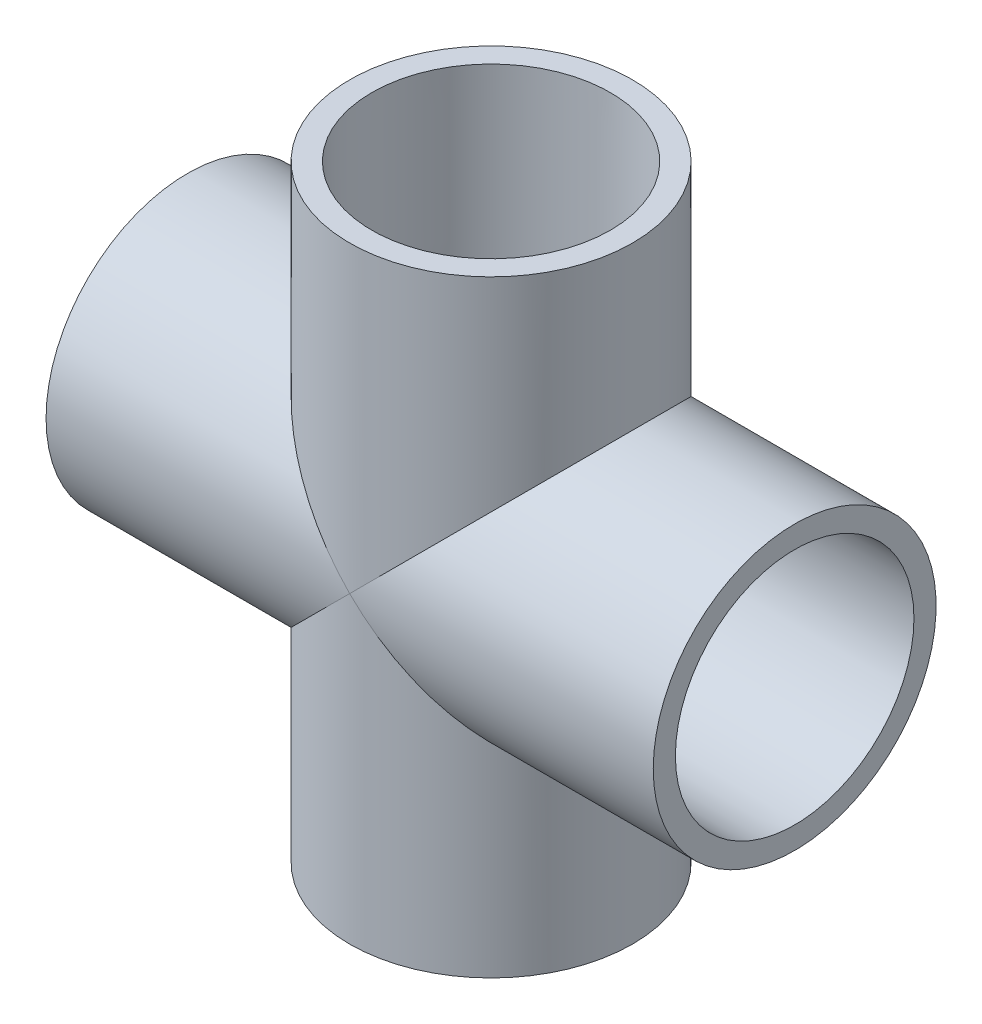
ISO-10303-21;
HEADER;
FILE_DESCRIPTION(('STEP AP214'),'2;1');
FILE_NAME('part.step','',(''),(''),'','','');
FILE_SCHEMA(('AUTOMOTIVE_DESIGN { 1 0 10303 214 1 1 1 1 }'));
ENDSEC;
DATA;
#1=APPLICATION_CONTEXT('core data for automotive mechanical design processes');
#2=APPLICATION_PROTOCOL_DEFINITION('international standard','automotive_design',2000,#1);
#3=PRODUCT_CONTEXT('',#1,'mechanical');
#4=PRODUCT('Part','Part','',(#3));
#5=PRODUCT_RELATED_PRODUCT_CATEGORY('part','',(#4));
#6=PRODUCT_DEFINITION_FORMATION('','',#4);
#7=PRODUCT_DEFINITION_CONTEXT('part definition',#1,'design');
#8=PRODUCT_DEFINITION('design','',#6,#7);
#9=PRODUCT_DEFINITION_SHAPE('','',#8);
#10=(LENGTH_UNIT() NAMED_UNIT(*) SI_UNIT(.MILLI.,.METRE.));
#11=(NAMED_UNIT(*) PLANE_ANGLE_UNIT() SI_UNIT($,.RADIAN.));
#12=(NAMED_UNIT(*) SI_UNIT($,.STERADIAN.) SOLID_ANGLE_UNIT());
#13=UNCERTAINTY_MEASURE_WITH_UNIT(LENGTH_MEASURE(1.E-05),#10,'distance_accuracy_value','');
#14=(GEOMETRIC_REPRESENTATION_CONTEXT(3) GLOBAL_UNCERTAINTY_ASSIGNED_CONTEXT((#13)) GLOBAL_UNIT_ASSIGNED_CONTEXT((#10,
#11,#12)) REPRESENTATION_CONTEXT('',''));
#15=CARTESIAN_POINT('',(0.,0.,0.));
#16=DIRECTION('',(0.,0.,1.));
#17=DIRECTION('',(1.,0.,0.));
#18=AXIS2_PLACEMENT_3D('',#15,#16,#17);
#19=CARTESIAN_POINT('',(0.,22.225,0.));
#20=DIRECTION('',(0.,-1.,0.));
#21=DIRECTION('',(1.,0.,0.));
#22=AXIS2_PLACEMENT_3D('',#19,#20,#21);
#23=PLANE('',#22);
#24=CARTESIAN_POINT('',(0.,22.225,0.));
#25=DIRECTION('',(0.,-1.,0.));
#26=DIRECTION('',(1.,0.,0.));
#27=AXIS2_PLACEMENT_3D('',#24,#25,#26);
#28=CIRCLE('',#27,21.0185);
#29=CARTESIAN_POINT('',(21.0185,22.225,0.));
#30=VERTEX_POINT('',#29);
#31=EDGE_CURVE('E80',#30,#30,#28,.T.);
#32=ORIENTED_EDGE('',*,*,#31,.F.);
#33=EDGE_LOOP('',(#32));
#34=FACE_BOUND('',#33,.T.);
#35=CARTESIAN_POINT('',(0.,22.225,0.));
#36=DIRECTION('',(0.,1.,0.));
#37=DIRECTION('',(-1.,0.,0.));
#38=AXIS2_PLACEMENT_3D('',#35,#36,#37);
#39=CIRCLE('',#38,17.526);
#40=CARTESIAN_POINT('',(-17.526,22.225,0.));
#41=VERTEX_POINT('',#40);
#42=EDGE_CURVE('E124',#41,#41,#39,.T.);
#43=ORIENTED_EDGE('',*,*,#42,.F.);
#44=EDGE_LOOP('',(#43));
#45=FACE_BOUND('',#44,.T.);
#46=ADVANCED_FACE('F32',(#34,#45),#23,.F.);
#47=CARTESIAN_POINT('',(0.,-22.225,0.));
#48=DIRECTION('',(0.,-1.,0.));
#49=DIRECTION('',(1.,0.,0.));
#50=AXIS2_PLACEMENT_3D('',#47,#48,#49);
#51=PLANE('',#50);
#52=CARTESIAN_POINT('',(0.,-22.225,0.));
#53=DIRECTION('',(0.,1.,0.));
#54=DIRECTION('',(-1.,0.,0.));
#55=AXIS2_PLACEMENT_3D('',#52,#53,#54);
#56=CIRCLE('',#55,17.526);
#57=CARTESIAN_POINT('',(-17.526,-22.225,0.));
#58=VERTEX_POINT('',#57);
#59=EDGE_CURVE('E127',#58,#58,#56,.T.);
#60=ORIENTED_EDGE('',*,*,#59,.T.);
#61=EDGE_LOOP('',(#60));
#62=FACE_BOUND('',#61,.T.);
#63=CARTESIAN_POINT('',(0.,-22.225,0.));
#64=DIRECTION('',(0.,-1.,0.));
#65=DIRECTION('',(1.,0.,0.));
#66=AXIS2_PLACEMENT_3D('',#63,#64,#65);
#67=CIRCLE('',#66,21.0185);
#68=CARTESIAN_POINT('',(21.0185,-22.225,0.));
#69=VERTEX_POINT('',#68);
#70=EDGE_CURVE('E115',#69,#69,#67,.T.);
#71=ORIENTED_EDGE('',*,*,#70,.T.);
#72=EDGE_LOOP('',(#71));
#73=FACE_BOUND('',#72,.T.);
#74=ADVANCED_FACE('F131',(#62,#73),#51,.T.);
#75=CARTESIAN_POINT('',(53.975,0.,0.));
#76=DIRECTION('',(1.,0.,0.));
#77=DIRECTION('',(0.,0.,-1.));
#78=AXIS2_PLACEMENT_3D('',#75,#76,#77);
#79=CYLINDRICAL_SURFACE('',#78,17.526);
#80=CARTESIAN_POINT('',(22.225,0.,0.));
#81=DIRECTION('',(1.,0.,0.));
#82=DIRECTION('',(0.,0.,-1.));
#83=AXIS2_PLACEMENT_3D('',#80,#81,#82);
#84=CIRCLE('',#83,17.526);
#85=CARTESIAN_POINT('',(22.225,0.,-17.526));
#86=VERTEX_POINT('',#85);
#87=EDGE_CURVE('E121',#86,#86,#84,.T.);
#88=ORIENTED_EDGE('',*,*,#87,.T.);
#89=EDGE_LOOP('',(#88));
#90=FACE_BOUND('',#89,.T.);
#91=CARTESIAN_POINT('',(0.,0.,0.));
#92=DIRECTION('',(0.707106781186548,-0.707106781186547,0.));
#93=DIRECTION('',(0.707106781186547,0.707106781186548,0.));
#94=AXIS2_PLACEMENT_3D('',#91,#92,#93);
#95=ELLIPSE('',#94,24.7855068941509,17.526);
#96=CARTESIAN_POINT('',(0.,0.,17.526));
#97=VERTEX_POINT('',#96);
#98=CARTESIAN_POINT('',(0.,0.,-17.526));
#99=VERTEX_POINT('',#98);
#100=EDGE_CURVE('E45',#97,#99,#95,.F.);
#101=ORIENTED_EDGE('',*,*,#100,.T.);
#102=CARTESIAN_POINT('',(0.,0.,0.));
#103=DIRECTION('',(0.707106781186547,0.707106781186548,0.));
#104=DIRECTION('',(0.707106781186548,-0.707106781186547,0.));
#105=AXIS2_PLACEMENT_3D('',#102,#103,#104);
#106=ELLIPSE('',#105,24.7855068941509,17.526);
#107=EDGE_CURVE('E11',#99,#97,#106,.F.);
#108=ORIENTED_EDGE('',*,*,#107,.T.);
#109=EDGE_LOOP('',(#101,#108));
#110=FACE_BOUND('',#109,.T.);
#111=ADVANCED_FACE('F72',(#90,#110),#79,.F.);
#112=CARTESIAN_POINT('',(-22.225,0.,0.));
#113=DIRECTION('',(1.,0.,0.));
#114=DIRECTION('',(0.,0.,-1.));
#115=AXIS2_PLACEMENT_3D('',#112,#113,#114);
#116=CIRCLE('',#115,17.526);
#117=CARTESIAN_POINT('',(-22.225,0.,-17.526));
#118=VERTEX_POINT('',#117);
#119=EDGE_CURVE('E118',#118,#118,#116,.T.);
#120=ORIENTED_EDGE('',*,*,#119,.F.);
#121=EDGE_LOOP('',(#120));
#122=FACE_BOUND('',#121,.T.);
#123=CARTESIAN_POINT('',(0.,0.,0.));
#124=DIRECTION('',(0.707106781186548,-0.707106781186547,0.));
#125=DIRECTION('',(0.707106781186547,0.707106781186548,0.));
#126=AXIS2_PLACEMENT_3D('',#123,#124,#125);
#127=ELLIPSE('',#126,24.7855068941509,17.526);
#128=EDGE_CURVE('E62',#97,#99,#127,.T.);
#129=ORIENTED_EDGE('',*,*,#128,.T.);
#130=CARTESIAN_POINT('',(0.,0.,0.));
#131=DIRECTION('',(0.707106781186547,0.707106781186548,0.));
#132=DIRECTION('',(0.707106781186548,-0.707106781186547,0.));
#133=AXIS2_PLACEMENT_3D('',#130,#131,#132);
#134=ELLIPSE('',#133,24.7855068941509,17.526);
#135=EDGE_CURVE('E40',#99,#97,#134,.T.);
#136=ORIENTED_EDGE('',*,*,#135,.T.);
#137=EDGE_LOOP('',(#129,#136));
#138=FACE_BOUND('',#137,.T.);
#139=ADVANCED_FACE('F73',(#122,#138),#79,.F.);
#140=CARTESIAN_POINT('',(-22.225,0.,0.));
#141=DIRECTION('',(1.,0.,0.));
#142=DIRECTION('',(0.,0.,-1.));
#143=AXIS2_PLACEMENT_3D('',#140,#141,#142);
#144=PLANE('',#143);
#145=ORIENTED_EDGE('',*,*,#119,.T.);
#146=EDGE_LOOP('',(#145));
#147=FACE_BOUND('',#146,.T.);
#148=CARTESIAN_POINT('',(-22.225,0.,0.));
#149=DIRECTION('',(-1.,0.,0.));
#150=DIRECTION('',(0.,0.,1.));
#151=AXIS2_PLACEMENT_3D('',#148,#149,#150);
#152=CIRCLE('',#151,21.0185);
#153=CARTESIAN_POINT('',(-22.225,0.,21.0185));
#154=VERTEX_POINT('',#153);
#155=EDGE_CURVE('E92',#154,#154,#152,.T.);
#156=ORIENTED_EDGE('',*,*,#155,.T.);
#157=EDGE_LOOP('',(#156));
#158=FACE_BOUND('',#157,.T.);
#159=ADVANCED_FACE('F179',(#147,#158),#144,.F.);
#160=CARTESIAN_POINT('',(22.225,0.,0.));
#161=DIRECTION('',(1.,0.,0.));
#162=DIRECTION('',(0.,0.,-1.));
#163=AXIS2_PLACEMENT_3D('',#160,#161,#162);
#164=PLANE('',#163);
#165=CARTESIAN_POINT('',(22.225,0.,0.));
#166=DIRECTION('',(1.,0.,0.));
#167=DIRECTION('',(0.,0.,-1.));
#168=AXIS2_PLACEMENT_3D('',#165,#166,#167);
#169=CIRCLE('',#168,21.0185);
#170=CARTESIAN_POINT('',(22.225,0.,-21.0185));
#171=VERTEX_POINT('',#170);
#172=EDGE_CURVE('E70',#171,#171,#169,.F.);
#173=ORIENTED_EDGE('',*,*,#172,.F.);
#174=EDGE_LOOP('',(#173));
#175=FACE_BOUND('',#174,.T.);
#176=ORIENTED_EDGE('',*,*,#87,.F.);
#177=EDGE_LOOP('',(#176));
#178=FACE_BOUND('',#177,.T.);
#179=ADVANCED_FACE('F175',(#175,#178),#164,.T.);
#180=CARTESIAN_POINT('',(22.225,0.,0.));
#181=DIRECTION('',(-1.,0.,0.));
#182=DIRECTION('',(0.,0.,1.));
#183=AXIS2_PLACEMENT_3D('',#180,#181,#182);
#184=CYLINDRICAL_SURFACE('',#183,25.146);
#185=CARTESIAN_POINT('',(53.975,0.,0.));
#186=DIRECTION('',(-1.,0.,0.));
#187=DIRECTION('',(0.,0.,1.));
#188=AXIS2_PLACEMENT_3D('',#185,#186,#187);
#189=CIRCLE('',#188,25.146);
#190=CARTESIAN_POINT('',(53.975,0.,25.146));
#191=VERTEX_POINT('',#190);
#192=EDGE_CURVE('E103',#191,#191,#189,.T.);
#193=ORIENTED_EDGE('',*,*,#192,.T.);
#194=EDGE_LOOP('',(#193));
#195=FACE_BOUND('',#194,.T.);
#196=CARTESIAN_POINT('',(0.,0.,0.));
#197=DIRECTION('',(-0.707106781186547,-0.707106781186547,0.));
#198=DIRECTION('',(-0.707106781186547,0.707106781186547,0.));
#199=AXIS2_PLACEMENT_3D('',#196,#197,#198);
#200=ELLIPSE('',#199,35.5618142394338,25.146);
#201=CARTESIAN_POINT('',(0.,0.,-25.146));
#202=VERTEX_POINT('',#201);
#203=CARTESIAN_POINT('',(0.,0.,25.146));
#204=VERTEX_POINT('',#203);
#205=EDGE_CURVE('E107',#202,#204,#200,.T.);
#206=ORIENTED_EDGE('',*,*,#205,.F.);
#207=CARTESIAN_POINT('',(0.,0.,0.));
#208=DIRECTION('',(0.707106781186547,-0.707106781186547,0.));
#209=DIRECTION('',(-0.707106781186547,-0.707106781186547,0.));
#210=AXIS2_PLACEMENT_3D('',#207,#208,#209);
#211=ELLIPSE('',#210,35.5618142394338,25.146);
#212=EDGE_CURVE('E98',#202,#204,#211,.T.);
#213=ORIENTED_EDGE('',*,*,#212,.T.);
#214=EDGE_LOOP('',(#206,#213));
#215=FACE_BOUND('',#214,.T.);
#216=ADVANCED_FACE('F178',(#195,#215),#184,.T.);
#217=CARTESIAN_POINT('',(-53.975,0.,0.));
#218=DIRECTION('',(-1.,0.,0.));
#219=DIRECTION('',(0.,0.,1.));
#220=AXIS2_PLACEMENT_3D('',#217,#218,#219);
#221=CIRCLE('',#220,25.146);
#222=CARTESIAN_POINT('',(-53.975,0.,25.146));
#223=VERTEX_POINT('',#222);
#224=EDGE_CURVE('E95',#223,#223,#221,.T.);
#225=ORIENTED_EDGE('',*,*,#224,.F.);
#226=EDGE_LOOP('',(#225));
#227=FACE_BOUND('',#226,.T.);
#228=CARTESIAN_POINT('',(0.,0.,0.));
#229=DIRECTION('',(-0.707106781186547,-0.707106781186547,0.));
#230=DIRECTION('',(0.707106781186547,-0.707106781186547,0.));
#231=AXIS2_PLACEMENT_3D('',#228,#229,#230);
#232=ELLIPSE('',#231,35.5618142394338,25.146);
#233=EDGE_CURVE('E86',#204,#202,#232,.T.);
#234=ORIENTED_EDGE('',*,*,#233,.T.);
#235=CARTESIAN_POINT('',(0.,0.,0.));
#236=DIRECTION('',(-0.707106781186547,0.707106781186547,0.));
#237=DIRECTION('',(-0.707106781186547,-0.707106781186547,0.));
#238=AXIS2_PLACEMENT_3D('',#235,#236,#237);
#239=ELLIPSE('',#238,35.5618142394338,25.146);
#240=EDGE_CURVE('E52',#204,#202,#239,.F.);
#241=ORIENTED_EDGE('',*,*,#240,.F.);
#242=EDGE_LOOP('',(#234,#241));
#243=FACE_BOUND('',#242,.T.);
#244=ADVANCED_FACE('F169',(#227,#243),#184,.T.);
#245=CARTESIAN_POINT('',(-22.225,0.,0.));
#246=DIRECTION('',(-1.,0.,0.));
#247=DIRECTION('',(0.,0.,1.));
#248=AXIS2_PLACEMENT_3D('',#245,#246,#247);
#249=CONICAL_SURFACE('',#248,21.0185,0.00599992800155515);
#250=CARTESIAN_POINT('',(-53.975,0.,0.));
#251=DIRECTION('',(-1.,0.,0.));
#252=DIRECTION('',(0.,0.,1.));
#253=AXIS2_PLACEMENT_3D('',#250,#251,#252);
#254=CIRCLE('',#253,21.209);
#255=CARTESIAN_POINT('',(-53.975,0.,21.209));
#256=VERTEX_POINT('',#255);
#257=EDGE_CURVE('E89',#256,#256,#254,.T.);
#258=ORIENTED_EDGE('',*,*,#257,.T.);
#259=EDGE_LOOP('',(#258));
#260=FACE_BOUND('',#259,.T.);
#261=ORIENTED_EDGE('',*,*,#155,.F.);
#262=EDGE_LOOP('',(#261));
#263=FACE_BOUND('',#262,.T.);
#264=ADVANCED_FACE('F161',(#260,#263),#249,.F.);
#265=CARTESIAN_POINT('',(53.975,0.,0.));
#266=DIRECTION('',(1.,0.,0.));
#267=DIRECTION('',(0.,0.,-1.));
#268=AXIS2_PLACEMENT_3D('',#265,#266,#267);
#269=CONICAL_SURFACE('',#268,21.209,0.00599992800155493);
#270=CARTESIAN_POINT('',(53.975,0.,0.));
#271=DIRECTION('',(-1.,0.,0.));
#272=DIRECTION('',(0.,0.,1.));
#273=AXIS2_PLACEMENT_3D('',#270,#271,#272);
#274=CIRCLE('',#273,21.209);
#275=CARTESIAN_POINT('',(53.975,0.,21.209));
#276=VERTEX_POINT('',#275);
#277=EDGE_CURVE('E100',#276,#276,#274,.T.);
#278=ORIENTED_EDGE('',*,*,#277,.F.);
#279=EDGE_LOOP('',(#278));
#280=FACE_BOUND('',#279,.T.);
#281=ORIENTED_EDGE('',*,*,#172,.T.);
#282=EDGE_LOOP('',(#281));
#283=FACE_BOUND('',#282,.T.);
#284=ADVANCED_FACE('F157',(#280,#283),#269,.F.);
#285=CARTESIAN_POINT('',(0.,53.975,0.));
#286=DIRECTION('',(0.,1.,0.));
#287=DIRECTION('',(-1.,0.,0.));
#288=AXIS2_PLACEMENT_3D('',#285,#286,#287);
#289=CONICAL_SURFACE('',#288,21.209,0.00599992800155515);
#290=CARTESIAN_POINT('',(0.,53.975,0.));
#291=DIRECTION('',(0.,-1.,0.));
#292=DIRECTION('',(1.,0.,0.));
#293=AXIS2_PLACEMENT_3D('',#290,#291,#292);
#294=CIRCLE('',#293,21.209);
#295=CARTESIAN_POINT('',(21.209,53.975,0.));
#296=VERTEX_POINT('',#295);
#297=EDGE_CURVE('E83',#296,#296,#294,.T.);
#298=ORIENTED_EDGE('',*,*,#297,.F.);
#299=EDGE_LOOP('',(#298));
#300=FACE_BOUND('',#299,.T.);
#301=ORIENTED_EDGE('',*,*,#31,.T.);
#302=EDGE_LOOP('',(#301));
#303=FACE_BOUND('',#302,.T.);
#304=ADVANCED_FACE('F160',(#300,#303),#289,.F.);
#305=CARTESIAN_POINT('',(25.146,53.975,0.));
#306=DIRECTION('',(0.,1.,0.));
#307=DIRECTION('',(-1.,0.,0.));
#308=AXIS2_PLACEMENT_3D('',#305,#306,#307);
#309=PLANE('',#308);
#310=ORIENTED_EDGE('',*,*,#297,.T.);
#311=EDGE_LOOP('',(#310));
#312=FACE_BOUND('',#311,.T.);
#313=CARTESIAN_POINT('',(0.,53.975,0.));
#314=DIRECTION('',(0.,-1.,0.));
#315=DIRECTION('',(1.,0.,0.));
#316=AXIS2_PLACEMENT_3D('',#313,#314,#315);
#317=CIRCLE('',#316,25.146);
#318=CARTESIAN_POINT('',(25.146,53.975,0.));
#319=VERTEX_POINT('',#318);
#320=EDGE_CURVE('E77',#319,#319,#317,.T.);
#321=ORIENTED_EDGE('',*,*,#320,.F.);
#322=EDGE_LOOP('',(#321));
#323=FACE_BOUND('',#322,.T.);
#324=ADVANCED_FACE('F34',(#312,#323),#309,.T.);
#325=CARTESIAN_POINT('',(0.,0.,0.));
#326=DIRECTION('',(0.,-1.,0.));
#327=DIRECTION('',(1.,0.,0.));
#328=AXIS2_PLACEMENT_3D('',#325,#326,#327);
#329=CYLINDRICAL_SURFACE('',#328,25.146);
#330=ORIENTED_EDGE('',*,*,#212,.F.);
#331=ORIENTED_EDGE('',*,*,#233,.F.);
#332=EDGE_LOOP('',(#330,#331));
#333=FACE_BOUND('',#332,.T.);
#334=ORIENTED_EDGE('',*,*,#320,.T.);
#335=EDGE_LOOP('',(#334));
#336=FACE_BOUND('',#335,.T.);
#337=ADVANCED_FACE('F173',(#333,#336),#329,.T.);
#338=CARTESIAN_POINT('',(-53.975,-25.146,0.));
#339=DIRECTION('',(-1.,0.,0.));
#340=DIRECTION('',(0.,0.,1.));
#341=AXIS2_PLACEMENT_3D('',#338,#339,#340);
#342=PLANE('',#341);
#343=ORIENTED_EDGE('',*,*,#224,.T.);
#344=EDGE_LOOP('',(#343));
#345=FACE_BOUND('',#344,.T.);
#346=ORIENTED_EDGE('',*,*,#257,.F.);
#347=EDGE_LOOP('',(#346));
#348=FACE_BOUND('',#347,.T.);
#349=ADVANCED_FACE('F165',(#345,#348),#342,.T.);
#350=CARTESIAN_POINT('',(53.975,-25.146,0.));
#351=DIRECTION('',(1.,0.,0.));
#352=DIRECTION('',(0.,0.,-1.));
#353=AXIS2_PLACEMENT_3D('',#350,#351,#352);
#354=PLANE('',#353);
#355=ORIENTED_EDGE('',*,*,#277,.T.);
#356=EDGE_LOOP('',(#355));
#357=FACE_BOUND('',#356,.T.);
#358=ORIENTED_EDGE('',*,*,#192,.F.);
#359=EDGE_LOOP('',(#358));
#360=FACE_BOUND('',#359,.T.);
#361=ADVANCED_FACE('F156',(#357,#360),#354,.T.);
#362=CARTESIAN_POINT('',(0.,-22.225,0.));
#363=DIRECTION('',(0.,1.,0.));
#364=DIRECTION('',(-1.,0.,0.));
#365=AXIS2_PLACEMENT_3D('',#362,#363,#364);
#366=CYLINDRICAL_SURFACE('',#365,25.146);
#367=ORIENTED_EDGE('',*,*,#205,.T.);
#368=ORIENTED_EDGE('',*,*,#240,.T.);
#369=EDGE_LOOP('',(#367,#368));
#370=FACE_BOUND('',#369,.T.);
#371=CARTESIAN_POINT('',(0.,-53.975,0.));
#372=DIRECTION('',(0.,-1.,0.));
#373=DIRECTION('',(1.,0.,0.));
#374=AXIS2_PLACEMENT_3D('',#371,#372,#373);
#375=CIRCLE('',#374,25.146);
#376=CARTESIAN_POINT('',(25.146,-53.975,0.));
#377=VERTEX_POINT('',#376);
#378=EDGE_CURVE('E109',#377,#377,#375,.T.);
#379=ORIENTED_EDGE('',*,*,#378,.F.);
#380=EDGE_LOOP('',(#379));
#381=FACE_BOUND('',#380,.T.);
#382=ADVANCED_FACE('F152',(#370,#381),#366,.T.);
#383=CARTESIAN_POINT('',(0.,-22.225,0.));
#384=DIRECTION('',(0.,-1.,0.));
#385=DIRECTION('',(1.,0.,0.));
#386=AXIS2_PLACEMENT_3D('',#383,#384,#385);
#387=CONICAL_SURFACE('',#386,21.0185,0.00599992800155515);
#388=CARTESIAN_POINT('',(0.,-53.975,0.));
#389=DIRECTION('',(0.,-1.,0.));
#390=DIRECTION('',(1.,0.,0.));
#391=AXIS2_PLACEMENT_3D('',#388,#389,#390);
#392=CIRCLE('',#391,21.209);
#393=CARTESIAN_POINT('',(21.209,-53.975,0.));
#394=VERTEX_POINT('',#393);
#395=EDGE_CURVE('E112',#394,#394,#392,.T.);
#396=ORIENTED_EDGE('',*,*,#395,.T.);
#397=EDGE_LOOP('',(#396));
#398=FACE_BOUND('',#397,.T.);
#399=ORIENTED_EDGE('',*,*,#70,.F.);
#400=EDGE_LOOP('',(#399));
#401=FACE_BOUND('',#400,.T.);
#402=ADVANCED_FACE('F155',(#398,#401),#387,.F.);
#403=CARTESIAN_POINT('',(25.146,-53.975,0.));
#404=DIRECTION('',(0.,-1.,0.));
#405=DIRECTION('',(1.,0.,0.));
#406=AXIS2_PLACEMENT_3D('',#403,#404,#405);
#407=PLANE('',#406);
#408=ORIENTED_EDGE('',*,*,#378,.T.);
#409=EDGE_LOOP('',(#408));
#410=FACE_BOUND('',#409,.T.);
#411=ORIENTED_EDGE('',*,*,#395,.F.);
#412=EDGE_LOOP('',(#411));
#413=FACE_BOUND('',#412,.T.);
#414=ADVANCED_FACE('F138',(#410,#413),#407,.T.);
#415=CARTESIAN_POINT('',(0.,53.975,0.));
#416=DIRECTION('',(0.,1.,0.));
#417=DIRECTION('',(-1.,0.,0.));
#418=AXIS2_PLACEMENT_3D('',#415,#416,#417);
#419=CYLINDRICAL_SURFACE('',#418,17.526);
#420=ORIENTED_EDGE('',*,*,#42,.T.);
#421=EDGE_LOOP('',(#420));
#422=FACE_BOUND('',#421,.T.);
#423=ORIENTED_EDGE('',*,*,#100,.F.);
#424=ORIENTED_EDGE('',*,*,#135,.F.);
#425=EDGE_LOOP('',(#423,#424));
#426=FACE_BOUND('',#425,.T.);
#427=ADVANCED_FACE('F69',(#422,#426),#419,.F.);
#428=ORIENTED_EDGE('',*,*,#128,.F.);
#429=ORIENTED_EDGE('',*,*,#107,.F.);
#430=EDGE_LOOP('',(#428,#429));
#431=FACE_BOUND('',#430,.T.);
#432=ORIENTED_EDGE('',*,*,#59,.F.);
#433=EDGE_LOOP('',(#432));
#434=FACE_BOUND('',#433,.T.);
#435=ADVANCED_FACE('F63',(#431,#434),#419,.F.);
#436=CLOSED_SHELL('',(#46,#74,#111,#139,#159,#179,#216,#244,#264,#284,#304,#324,#337,#349,#361,
#382,#402,#414,#427,#435));
#437=MANIFOLD_SOLID_BREP('B2',#436);
#438=ADVANCED_BREP_SHAPE_REPRESENTATION('',(#18,#437),#14);
#439=SHAPE_DEFINITION_REPRESENTATION(#9,#438);
ENDSEC;
END-ISO-10303-21;
